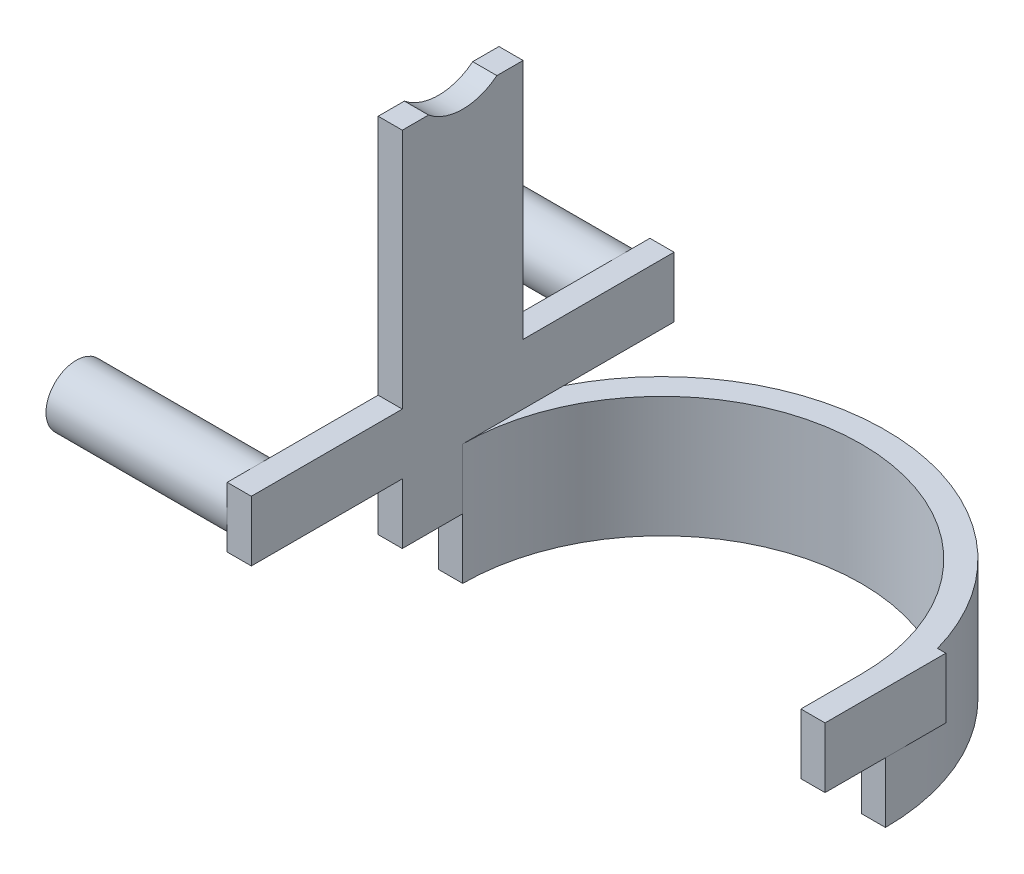
ISO-10303-21;
HEADER;
FILE_DESCRIPTION(('STEP AP214'),'2;1');
FILE_NAME('part.step','',(''),(''),'','','');
FILE_SCHEMA(('AUTOMOTIVE_DESIGN { 1 0 10303 214 1 1 1 1 }'));
ENDSEC;
DATA;
#1=APPLICATION_CONTEXT('core data for automotive mechanical design processes');
#2=APPLICATION_PROTOCOL_DEFINITION('international standard','automotive_design',2000,#1);
#3=PRODUCT_CONTEXT('',#1,'mechanical');
#4=PRODUCT('Part','Part','',(#3));
#5=PRODUCT_RELATED_PRODUCT_CATEGORY('part','',(#4));
#6=PRODUCT_DEFINITION_FORMATION('','',#4);
#7=PRODUCT_DEFINITION_CONTEXT('part definition',#1,'design');
#8=PRODUCT_DEFINITION('design','',#6,#7);
#9=PRODUCT_DEFINITION_SHAPE('','',#8);
#10=(LENGTH_UNIT() NAMED_UNIT(*) SI_UNIT(.MILLI.,.METRE.));
#11=(NAMED_UNIT(*) PLANE_ANGLE_UNIT() SI_UNIT($,.RADIAN.));
#12=(NAMED_UNIT(*) SI_UNIT($,.STERADIAN.) SOLID_ANGLE_UNIT());
#13=UNCERTAINTY_MEASURE_WITH_UNIT(LENGTH_MEASURE(1.E-05),#10,'distance_accuracy_value','');
#14=(GEOMETRIC_REPRESENTATION_CONTEXT(3) GLOBAL_UNCERTAINTY_ASSIGNED_CONTEXT((#13)) GLOBAL_UNIT_ASSIGNED_CONTEXT((#10,
#11,#12)) REPRESENTATION_CONTEXT('',''));
#15=CARTESIAN_POINT('',(0.,0.,0.));
#16=DIRECTION('',(0.,0.,1.));
#17=DIRECTION('',(1.,0.,0.));
#18=AXIS2_PLACEMENT_3D('',#15,#16,#17);
#19=CARTESIAN_POINT('',(-74.,40.,-20.));
#20=DIRECTION('',(1.,0.,0.));
#21=DIRECTION('',(0.,0.,-1.));
#22=AXIS2_PLACEMENT_3D('',#19,#20,#21);
#23=PLANE('',#22);
#24=CARTESIAN_POINT('',(-74.,50.,60.));
#25=DIRECTION('',(-1.,0.,0.));
#26=DIRECTION('',(0.,0.,1.));
#27=AXIS2_PLACEMENT_3D('',#24,#25,#26);
#28=CIRCLE('',#27,9.99999999999999);
#29=CARTESIAN_POINT('',(-74.,40.,60.));
#30=VERTEX_POINT('',#29);
#31=CARTESIAN_POINT('',(-74.,50.,70.));
#32=VERTEX_POINT('',#31);
#33=EDGE_CURVE('E239',#30,#32,#28,.T.);
#34=ORIENTED_EDGE('',*,*,#33,.F.);
#35=DIRECTION('',(0.,0.,1.));
#36=VECTOR('',#35,1.);
#37=CARTESIAN_POINT('',(-74.,40.,-70.));
#38=LINE('',#37,#36);
#39=CARTESIAN_POINT('',(-74.,40.,70.));
#40=VERTEX_POINT('',#39);
#41=EDGE_CURVE('E225',#30,#40,#38,.T.);
#42=ORIENTED_EDGE('',*,*,#41,.T.);
#43=DIRECTION('',(0.,1.,0.));
#44=VECTOR('',#43,1.);
#45=CARTESIAN_POINT('',(-74.,60.,70.));
#46=LINE('',#45,#44);
#47=EDGE_CURVE('E240',#40,#32,#46,.T.);
#48=ORIENTED_EDGE('',*,*,#47,.T.);
#49=EDGE_LOOP('',(#34,#42,#48));
#50=FACE_BOUND('',#49,.T.);
#51=ADVANCED_FACE('F39',(#50),#23,.F.);
#52=CARTESIAN_POINT('',(-74.,60.,60.));
#53=VERTEX_POINT('',#52);
#54=EDGE_CURVE('E64',#32,#53,#28,.T.);
#55=ORIENTED_EDGE('',*,*,#54,.F.);
#56=CARTESIAN_POINT('',(-74.,60.,70.));
#57=VERTEX_POINT('',#56);
#58=EDGE_CURVE('E285',#32,#57,#46,.T.);
#59=ORIENTED_EDGE('',*,*,#58,.T.);
#60=DIRECTION('',(0.,0.,-1.));
#61=VECTOR('',#60,1.);
#62=CARTESIAN_POINT('',(-74.,60.,-70.));
#63=LINE('',#62,#61);
#64=EDGE_CURVE('E266',#57,#53,#63,.T.);
#65=ORIENTED_EDGE('',*,*,#64,.T.);
#66=EDGE_LOOP('',(#55,#59,#65));
#67=FACE_BOUND('',#66,.T.);
#68=ADVANCED_FACE('F552',(#67),#23,.F.);
#69=CARTESIAN_POINT('',(-74.,50.,-60.));
#70=DIRECTION('',(-1.,0.,0.));
#71=DIRECTION('',(0.,0.,1.));
#72=AXIS2_PLACEMENT_3D('',#69,#70,#71);
#73=CIRCLE('',#72,10.);
#74=CARTESIAN_POINT('',(-74.,50.,-70.));
#75=VERTEX_POINT('',#74);
#76=CARTESIAN_POINT('',(-74.,40.,-60.));
#77=VERTEX_POINT('',#76);
#78=EDGE_CURVE('E259',#75,#77,#73,.T.);
#79=ORIENTED_EDGE('',*,*,#78,.F.);
#80=DIRECTION('',(0.,-1.,0.));
#81=VECTOR('',#80,1.);
#82=CARTESIAN_POINT('',(-74.,60.,-70.));
#83=LINE('',#82,#81);
#84=CARTESIAN_POINT('',(-74.,40.,-70.));
#85=VERTEX_POINT('',#84);
#86=EDGE_CURVE('E254',#75,#85,#83,.T.);
#87=ORIENTED_EDGE('',*,*,#86,.T.);
#88=EDGE_CURVE('E227',#85,#77,#38,.T.);
#89=ORIENTED_EDGE('',*,*,#88,.T.);
#90=EDGE_LOOP('',(#79,#87,#89));
#91=FACE_BOUND('',#90,.T.);
#92=ADVANCED_FACE('F558',(#91),#23,.F.);
#93=EDGE_CURVE('E56',#53,#30,#28,.T.);
#94=ORIENTED_EDGE('',*,*,#93,.F.);
#95=CARTESIAN_POINT('',(-74.,60.,20.));
#96=VERTEX_POINT('',#95);
#97=EDGE_CURVE('E291',#53,#96,#63,.T.);
#98=ORIENTED_EDGE('',*,*,#97,.T.);
#99=DIRECTION('',(0.,-1.,0.));
#100=VECTOR('',#99,1.);
#101=CARTESIAN_POINT('',(-74.,40.,20.));
#102=LINE('',#101,#100);
#103=CARTESIAN_POINT('',(-74.,140.,20.));
#104=VERTEX_POINT('',#103);
#105=EDGE_CURVE('E459',#104,#96,#102,.T.);
#106=ORIENTED_EDGE('',*,*,#105,.F.);
#107=DIRECTION('',(0.,0.,1.));
#108=VECTOR('',#107,1.);
#109=CARTESIAN_POINT('',(-74.,140.,20.));
#110=LINE('',#109,#108);
#111=CARTESIAN_POINT('',(-74.,140.,11.3137084989847));
#112=VERTEX_POINT('',#111);
#113=EDGE_CURVE('E414',#112,#104,#110,.T.);
#114=ORIENTED_EDGE('',*,*,#113,.F.);
#115=CARTESIAN_POINT('',(-74.,154.,0.));
#116=DIRECTION('',(-1.,0.,0.));
#117=DIRECTION('',(0.,0.,1.));
#118=AXIS2_PLACEMENT_3D('',#115,#116,#117);
#119=CIRCLE('',#118,18.);
#120=CARTESIAN_POINT('',(-74.,140.,-11.3137084989847));
#121=VERTEX_POINT('',#120);
#122=EDGE_CURVE('E399',#121,#112,#119,.T.);
#123=ORIENTED_EDGE('',*,*,#122,.F.);
#124=CARTESIAN_POINT('',(-74.,140.,-20.));
#125=VERTEX_POINT('',#124);
#126=EDGE_CURVE('E415',#125,#121,#110,.T.);
#127=ORIENTED_EDGE('',*,*,#126,.F.);
#128=DIRECTION('',(0.,-1.,0.));
#129=VECTOR('',#128,1.);
#130=CARTESIAN_POINT('',(-74.,40.,-20.));
#131=LINE('',#130,#129);
#132=CARTESIAN_POINT('',(-74.,60.,-20.));
#133=VERTEX_POINT('',#132);
#134=EDGE_CURVE('E464',#125,#133,#131,.T.);
#135=ORIENTED_EDGE('',*,*,#134,.T.);
#136=CARTESIAN_POINT('',(-74.,60.,-60.));
#137=VERTEX_POINT('',#136);
#138=EDGE_CURVE('E292',#133,#137,#63,.T.);
#139=ORIENTED_EDGE('',*,*,#138,.T.);
#140=EDGE_CURVE('E260',#77,#137,#73,.T.);
#141=ORIENTED_EDGE('',*,*,#140,.F.);
#142=CARTESIAN_POINT('',(-74.,40.,-20.));
#143=VERTEX_POINT('',#142);
#144=EDGE_CURVE('E224',#77,#143,#38,.T.);
#145=ORIENTED_EDGE('',*,*,#144,.T.);
#146=CARTESIAN_POINT('',(-74.,20.,-20.));
#147=VERTEX_POINT('',#146);
#148=EDGE_CURVE('E463',#143,#147,#131,.T.);
#149=ORIENTED_EDGE('',*,*,#148,.T.);
#150=DIRECTION('',(0.,0.,-1.));
#151=VECTOR('',#150,1.);
#152=CARTESIAN_POINT('',(-74.,20.,-20.));
#153=LINE('',#152,#151);
#154=CARTESIAN_POINT('',(-74.,20.,0.));
#155=VERTEX_POINT('',#154);
#156=EDGE_CURVE('E373',#155,#147,#153,.T.);
#157=ORIENTED_EDGE('',*,*,#156,.F.);
#158=CARTESIAN_POINT('',(-74.,20.,20.));
#159=VERTEX_POINT('',#158);
#160=EDGE_CURVE('E359',#159,#155,#153,.T.);
#161=ORIENTED_EDGE('',*,*,#160,.F.);
#162=CARTESIAN_POINT('',(-74.,40.,20.));
#163=VERTEX_POINT('',#162);
#164=EDGE_CURVE('E219',#163,#159,#102,.T.);
#165=ORIENTED_EDGE('',*,*,#164,.F.);
#166=EDGE_CURVE('E215',#163,#30,#38,.T.);
#167=ORIENTED_EDGE('',*,*,#166,.T.);
#168=EDGE_LOOP('',(#94,#98,#106,#114,#123,#127,#135,#139,#141,#145,#149,#157,#161,#165,#167));
#169=FACE_BOUND('',#168,.T.);
#170=ADVANCED_FACE('F217',(#169),#23,.F.);
#171=CARTESIAN_POINT('',(-74.,40.,-20.));
#172=DIRECTION('',(0.,0.,1.));
#173=DIRECTION('',(1.,0.,0.));
#174=AXIS2_PLACEMENT_3D('',#171,#172,#173);
#175=PLANE('',#174);
#176=DIRECTION('',(0.,-1.,0.));
#177=VECTOR('',#176,1.);
#178=CARTESIAN_POINT('',(-66.,140.,-20.));
#179=LINE('',#178,#177);
#180=CARTESIAN_POINT('',(-66.,140.,-20.));
#181=VERTEX_POINT('',#180);
#182=CARTESIAN_POINT('',(-66.,60.,-20.));
#183=VERTEX_POINT('',#182);
#184=EDGE_CURVE('E431',#181,#183,#179,.T.);
#185=ORIENTED_EDGE('',*,*,#184,.T.);
#186=DIRECTION('',(-1.,0.,0.));
#187=VECTOR('',#186,1.);
#188=CARTESIAN_POINT('',(-74.,60.,-20.));
#189=LINE('',#188,#187);
#190=EDGE_CURVE('E316',#183,#133,#189,.T.);
#191=ORIENTED_EDGE('',*,*,#190,.T.);
#192=ORIENTED_EDGE('',*,*,#134,.F.);
#193=DIRECTION('',(-1.,0.,0.));
#194=VECTOR('',#193,1.);
#195=CARTESIAN_POINT('',(-74.,140.,-20.));
#196=LINE('',#195,#194);
#197=EDGE_CURVE('E428',#181,#125,#196,.T.);
#198=ORIENTED_EDGE('',*,*,#197,.F.);
#199=EDGE_LOOP('',(#185,#191,#192,#198));
#200=FACE_BOUND('',#199,.T.);
#201=ADVANCED_FACE('F574',(#200),#175,.F.);
#202=CARTESIAN_POINT('',(-74.,40.,20.));
#203=DIRECTION('',(0.,0.,-1.));
#204=DIRECTION('',(-1.,0.,0.));
#205=AXIS2_PLACEMENT_3D('',#202,#203,#204);
#206=PLANE('',#205);
#207=ORIENTED_EDGE('',*,*,#105,.T.);
#208=DIRECTION('',(1.,0.,0.));
#209=VECTOR('',#208,1.);
#210=CARTESIAN_POINT('',(-74.,60.,20.));
#211=LINE('',#210,#209);
#212=CARTESIAN_POINT('',(-66.,60.,20.));
#213=VERTEX_POINT('',#212);
#214=EDGE_CURVE('E311',#96,#213,#211,.T.);
#215=ORIENTED_EDGE('',*,*,#214,.T.);
#216=DIRECTION('',(0.,-1.,0.));
#217=VECTOR('',#216,1.);
#218=CARTESIAN_POINT('',(-66.,40.,20.));
#219=LINE('',#218,#217);
#220=CARTESIAN_POINT('',(-66.,140.,20.));
#221=VERTEX_POINT('',#220);
#222=EDGE_CURVE('E455',#221,#213,#219,.T.);
#223=ORIENTED_EDGE('',*,*,#222,.F.);
#224=DIRECTION('',(1.,0.,0.));
#225=VECTOR('',#224,1.);
#226=CARTESIAN_POINT('',(-74.,140.,20.));
#227=LINE('',#226,#225);
#228=EDGE_CURVE('E419',#104,#221,#227,.T.);
#229=ORIENTED_EDGE('',*,*,#228,.F.);
#230=EDGE_LOOP('',(#207,#215,#223,#229));
#231=FACE_BOUND('',#230,.T.);
#232=ADVANCED_FACE('F571',(#231),#206,.F.);
#233=CARTESIAN_POINT('',(0.,40.,0.));
#234=DIRECTION('',(0.,1.,0.));
#235=DIRECTION('',(0.,0.,1.));
#236=AXIS2_PLACEMENT_3D('',#233,#234,#235);
#237=PLANE('',#236);
#238=CARTESIAN_POINT('',(0.,40.,0.));
#239=DIRECTION('',(0.,1.,0.));
#240=DIRECTION('',(0.,0.,1.));
#241=AXIS2_PLACEMENT_3D('',#238,#239,#240);
#242=CIRCLE('',#241,74.);
#243=CARTESIAN_POINT('',(71.2460525222275,40.,-20.));
#244=VERTEX_POINT('',#243);
#245=CARTESIAN_POINT('',(-66.,40.,-33.466401061363));
#246=VERTEX_POINT('',#245);
#247=EDGE_CURVE('E441',#244,#246,#242,.T.);
#248=ORIENTED_EDGE('',*,*,#247,.T.);
#249=DIRECTION('',(0.,0.,-1.));
#250=VECTOR('',#249,1.);
#251=CARTESIAN_POINT('',(-66.,40.,20.));
#252=LINE('',#251,#250);
#253=CARTESIAN_POINT('',(-66.,40.,0.));
#254=VERTEX_POINT('',#253);
#255=EDGE_CURVE('E11',#254,#246,#252,.T.);
#256=ORIENTED_EDGE('',*,*,#255,.F.);
#257=CARTESIAN_POINT('',(0.,40.,0.));
#258=DIRECTION('',(0.,-1.,0.));
#259=DIRECTION('',(0.,0.,1.));
#260=AXIS2_PLACEMENT_3D('',#257,#258,#259);
#261=CIRCLE('',#260,66.);
#262=CARTESIAN_POINT('',(66.,40.,0.));
#263=VERTEX_POINT('',#262);
#264=EDGE_CURVE('E436',#254,#263,#261,.T.);
#265=ORIENTED_EDGE('',*,*,#264,.T.);
#266=DIRECTION('',(0.,0.,-1.));
#267=VECTOR('',#266,1.);
#268=CARTESIAN_POINT('',(66.,40.,0.));
#269=LINE('',#268,#267);
#270=CARTESIAN_POINT('',(66.,40.,20.));
#271=VERTEX_POINT('',#270);
#272=EDGE_CURVE('E395',#271,#263,#269,.T.);
#273=ORIENTED_EDGE('',*,*,#272,.F.);
#274=DIRECTION('',(-1.,0.,0.));
#275=VECTOR('',#274,1.);
#276=CARTESIAN_POINT('',(74.,40.,20.));
#277=LINE('',#276,#275);
#278=CARTESIAN_POINT('',(74.,40.,20.));
#279=VERTEX_POINT('',#278);
#280=EDGE_CURVE('E391',#279,#271,#277,.T.);
#281=ORIENTED_EDGE('',*,*,#280,.F.);
#282=DIRECTION('',(0.,0.,-1.));
#283=VECTOR('',#282,1.);
#284=CARTESIAN_POINT('',(74.,40.,-20.));
#285=LINE('',#284,#283);
#286=CARTESIAN_POINT('',(74.,40.,-20.));
#287=VERTEX_POINT('',#286);
#288=EDGE_CURVE('E384',#279,#287,#285,.T.);
#289=ORIENTED_EDGE('',*,*,#288,.T.);
#290=DIRECTION('',(1.,0.,0.));
#291=VECTOR('',#290,1.);
#292=CARTESIAN_POINT('',(64.,40.,-20.));
#293=LINE('',#292,#291);
#294=EDGE_CURVE('E387',#244,#287,#293,.T.);
#295=ORIENTED_EDGE('',*,*,#294,.F.);
#296=EDGE_LOOP('',(#248,#256,#265,#273,#281,#289,#295));
#297=FACE_BOUND('',#296,.T.);
#298=ADVANCED_FACE('F634',(#297),#237,.T.);
#299=CARTESIAN_POINT('',(66.,40.,0.));
#300=DIRECTION('',(1.,0.,0.));
#301=DIRECTION('',(0.,0.,-1.));
#302=AXIS2_PLACEMENT_3D('',#299,#300,#301);
#303=PLANE('',#302);
#304=DIRECTION('',(0.,0.,1.));
#305=VECTOR('',#304,1.);
#306=CARTESIAN_POINT('',(66.,20.,20.));
#307=LINE('',#306,#305);
#308=CARTESIAN_POINT('',(66.,20.,0.));
#309=VERTEX_POINT('',#308);
#310=CARTESIAN_POINT('',(66.,20.,20.));
#311=VERTEX_POINT('',#310);
#312=EDGE_CURVE('E342',#309,#311,#307,.T.);
#313=ORIENTED_EDGE('',*,*,#312,.T.);
#314=DIRECTION('',(0.,-1.,0.));
#315=VECTOR('',#314,1.);
#316=CARTESIAN_POINT('',(66.,40.,20.));
#317=LINE('',#316,#315);
#318=EDGE_CURVE('E483',#271,#311,#317,.T.);
#319=ORIENTED_EDGE('',*,*,#318,.F.);
#320=ORIENTED_EDGE('',*,*,#272,.T.);
#321=DIRECTION('',(0.,-1.,0.));
#322=VECTOR('',#321,1.);
#323=CARTESIAN_POINT('',(66.,40.,0.));
#324=LINE('',#323,#322);
#325=EDGE_CURVE('E43',#263,#309,#324,.T.);
#326=ORIENTED_EDGE('',*,*,#325,.T.);
#327=EDGE_LOOP('',(#313,#319,#320,#326));
#328=FACE_BOUND('',#327,.T.);
#329=ADVANCED_FACE('F492',(#328),#303,.F.);
#330=CARTESIAN_POINT('',(74.,40.,20.));
#331=DIRECTION('',(0.,0.,-1.));
#332=DIRECTION('',(-1.,0.,0.));
#333=AXIS2_PLACEMENT_3D('',#330,#331,#332);
#334=PLANE('',#333);
#335=DIRECTION('',(1.,0.,0.));
#336=VECTOR('',#335,1.);
#337=CARTESIAN_POINT('',(71.2460525222275,20.,20.));
#338=LINE('',#337,#336);
#339=CARTESIAN_POINT('',(74.,20.,20.));
#340=VERTEX_POINT('',#339);
#341=EDGE_CURVE('E346',#311,#340,#338,.T.);
#342=ORIENTED_EDGE('',*,*,#341,.T.);
#343=DIRECTION('',(0.,-1.,0.));
#344=VECTOR('',#343,1.);
#345=CARTESIAN_POINT('',(74.,40.,20.));
#346=LINE('',#345,#344);
#347=EDGE_CURVE('E480',#279,#340,#346,.T.);
#348=ORIENTED_EDGE('',*,*,#347,.F.);
#349=ORIENTED_EDGE('',*,*,#280,.T.);
#350=ORIENTED_EDGE('',*,*,#318,.T.);
#351=EDGE_LOOP('',(#342,#348,#349,#350));
#352=FACE_BOUND('',#351,.T.);
#353=ADVANCED_FACE('F632',(#352),#334,.F.);
#354=CARTESIAN_POINT('',(74.,40.,-20.));
#355=DIRECTION('',(-1.,0.,0.));
#356=DIRECTION('',(0.,0.,1.));
#357=AXIS2_PLACEMENT_3D('',#354,#355,#356);
#358=PLANE('',#357);
#359=DIRECTION('',(0.,0.,1.));
#360=VECTOR('',#359,1.);
#361=CARTESIAN_POINT('',(74.,20.,-20.));
#362=LINE('',#361,#360);
#363=CARTESIAN_POINT('',(74.,20.,-20.));
#364=VERTEX_POINT('',#363);
#365=CARTESIAN_POINT('',(74.,20.,0.));
#366=VERTEX_POINT('',#365);
#367=EDGE_CURVE('E380',#364,#366,#362,.T.);
#368=ORIENTED_EDGE('',*,*,#367,.F.);
#369=DIRECTION('',(0.,-1.,0.));
#370=VECTOR('',#369,1.);
#371=CARTESIAN_POINT('',(74.,40.,-20.));
#372=LINE('',#371,#370);
#373=EDGE_CURVE('E476',#287,#364,#372,.T.);
#374=ORIENTED_EDGE('',*,*,#373,.F.);
#375=ORIENTED_EDGE('',*,*,#288,.F.);
#376=ORIENTED_EDGE('',*,*,#347,.T.);
#377=EDGE_CURVE('E383',#366,#340,#362,.T.);
#378=ORIENTED_EDGE('',*,*,#377,.F.);
#379=EDGE_LOOP('',(#368,#374,#375,#376,#378));
#380=FACE_BOUND('',#379,.T.);
#381=ADVANCED_FACE('F630',(#380),#358,.F.);
#382=CARTESIAN_POINT('',(74.,40.,-20.));
#383=DIRECTION('',(0.,0.,1.));
#384=DIRECTION('',(1.,0.,0.));
#385=AXIS2_PLACEMENT_3D('',#382,#383,#384);
#386=PLANE('',#385);
#387=DIRECTION('',(1.,0.,0.));
#388=VECTOR('',#387,1.);
#389=CARTESIAN_POINT('',(74.,20.,-20.));
#390=LINE('',#389,#388);
#391=CARTESIAN_POINT('',(71.2460525222275,20.,-20.));
#392=VERTEX_POINT('',#391);
#393=EDGE_CURVE('E377',#392,#364,#390,.T.);
#394=ORIENTED_EDGE('',*,*,#393,.F.);
#395=DIRECTION('',(0.,-1.,0.));
#396=VECTOR('',#395,1.);
#397=CARTESIAN_POINT('',(71.2460525222275,40.,-20.));
#398=LINE('',#397,#396);
#399=EDGE_CURVE('E472',#244,#392,#398,.T.);
#400=ORIENTED_EDGE('',*,*,#399,.F.);
#401=ORIENTED_EDGE('',*,*,#294,.T.);
#402=ORIENTED_EDGE('',*,*,#373,.T.);
#403=EDGE_LOOP('',(#394,#400,#401,#402));
#404=FACE_BOUND('',#403,.T.);
#405=ADVANCED_FACE('F572',(#404),#386,.F.);
#406=ORIENTED_EDGE('',*,*,#148,.F.);
#407=DIRECTION('',(1.,0.,0.));
#408=VECTOR('',#407,1.);
#409=CARTESIAN_POINT('',(-74.,40.,-20.));
#410=LINE('',#409,#408);
#411=CARTESIAN_POINT('',(-71.2460525222275,40.,-20.));
#412=VERTEX_POINT('',#411);
#413=EDGE_CURVE('E307',#143,#412,#410,.T.);
#414=ORIENTED_EDGE('',*,*,#413,.T.);
#415=DIRECTION('',(0.,-1.,0.));
#416=VECTOR('',#415,1.);
#417=CARTESIAN_POINT('',(-71.2460525222275,40.,-20.));
#418=LINE('',#417,#416);
#419=CARTESIAN_POINT('',(-71.2460525222275,20.,-20.));
#420=VERTEX_POINT('',#419);
#421=EDGE_CURVE('E468',#412,#420,#418,.T.);
#422=ORIENTED_EDGE('',*,*,#421,.T.);
#423=DIRECTION('',(1.,0.,0.));
#424=VECTOR('',#423,1.);
#425=CARTESIAN_POINT('',(-74.,20.,-20.));
#426=LINE('',#425,#424);
#427=EDGE_CURVE('E374',#147,#420,#426,.T.);
#428=ORIENTED_EDGE('',*,*,#427,.F.);
#429=EDGE_LOOP('',(#406,#414,#422,#428));
#430=FACE_BOUND('',#429,.T.);
#431=ADVANCED_FACE('F563',(#430),#175,.F.);
#432=EDGE_CURVE('E255',#137,#75,#73,.T.);
#433=ORIENTED_EDGE('',*,*,#432,.F.);
#434=CARTESIAN_POINT('',(-74.,60.,-70.));
#435=VERTEX_POINT('',#434);
#436=EDGE_CURVE('E288',#137,#435,#63,.T.);
#437=ORIENTED_EDGE('',*,*,#436,.T.);
#438=EDGE_CURVE('E237',#435,#75,#83,.T.);
#439=ORIENTED_EDGE('',*,*,#438,.T.);
#440=EDGE_LOOP('',(#433,#437,#439));
#441=FACE_BOUND('',#440,.T.);
#442=ADVANCED_FACE('F554',(#441),#23,.F.);
#443=CARTESIAN_POINT('',(-66.,40.,20.));
#444=VERTEX_POINT('',#443);
#445=CARTESIAN_POINT('',(-66.,20.,20.));
#446=VERTEX_POINT('',#445);
#447=EDGE_CURVE('E454',#444,#446,#219,.T.);
#448=ORIENTED_EDGE('',*,*,#447,.F.);
#449=DIRECTION('',(-1.,0.,0.));
#450=VECTOR('',#449,1.);
#451=CARTESIAN_POINT('',(-74.,40.,20.));
#452=LINE('',#451,#450);
#453=EDGE_CURVE('E297',#444,#163,#452,.T.);
#454=ORIENTED_EDGE('',*,*,#453,.T.);
#455=ORIENTED_EDGE('',*,*,#164,.T.);
#456=DIRECTION('',(1.,0.,0.));
#457=VECTOR('',#456,1.);
#458=CARTESIAN_POINT('',(-71.2460525222275,20.,20.));
#459=LINE('',#458,#457);
#460=EDGE_CURVE('E320',#159,#446,#459,.T.);
#461=ORIENTED_EDGE('',*,*,#460,.T.);
#462=EDGE_LOOP('',(#448,#454,#455,#461));
#463=FACE_BOUND('',#462,.T.);
#464=ADVANCED_FACE('F562',(#463),#206,.F.);
#465=CARTESIAN_POINT('',(-66.,40.,0.));
#466=DIRECTION('',(-1.,0.,0.));
#467=DIRECTION('',(0.,0.,1.));
#468=AXIS2_PLACEMENT_3D('',#465,#466,#467);
#469=PLANE('',#468);
#470=DIRECTION('',(0.,-1.,0.));
#471=VECTOR('',#470,1.);
#472=CARTESIAN_POINT('',(-66.,40.,0.));
#473=LINE('',#472,#471);
#474=CARTESIAN_POINT('',(-66.,20.,0.));
#475=VERTEX_POINT('',#474);
#476=EDGE_CURVE('E445',#254,#475,#473,.T.);
#477=ORIENTED_EDGE('',*,*,#476,.F.);
#478=ORIENTED_EDGE('',*,*,#255,.T.);
#479=DIRECTION('',(0.,0.,1.));
#480=VECTOR('',#479,1.);
#481=CARTESIAN_POINT('',(-66.,40.,-70.));
#482=LINE('',#481,#480);
#483=CARTESIAN_POINT('',(-66.,40.,-70.));
#484=VERTEX_POINT('',#483);
#485=EDGE_CURVE('E267',#484,#246,#482,.T.);
#486=ORIENTED_EDGE('',*,*,#485,.F.);
#487=DIRECTION('',(0.,-1.,0.));
#488=VECTOR('',#487,1.);
#489=CARTESIAN_POINT('',(-66.,60.,-70.));
#490=LINE('',#489,#488);
#491=CARTESIAN_POINT('',(-66.,60.,-70.));
#492=VERTEX_POINT('',#491);
#493=EDGE_CURVE('E261',#492,#484,#490,.T.);
#494=ORIENTED_EDGE('',*,*,#493,.F.);
#495=DIRECTION('',(0.,0.,-1.));
#496=VECTOR('',#495,1.);
#497=CARTESIAN_POINT('',(-66.,60.,-70.));
#498=LINE('',#497,#496);
#499=EDGE_CURVE('E275',#183,#492,#498,.T.);
#500=ORIENTED_EDGE('',*,*,#499,.F.);
#501=ORIENTED_EDGE('',*,*,#184,.F.);
#502=DIRECTION('',(0.,0.,-1.));
#503=VECTOR('',#502,1.);
#504=CARTESIAN_POINT('',(-66.,140.,20.));
#505=LINE('',#504,#503);
#506=CARTESIAN_POINT('',(-66.,140.,-11.3137084989847));
#507=VERTEX_POINT('',#506);
#508=EDGE_CURVE('E423',#507,#181,#505,.T.);
#509=ORIENTED_EDGE('',*,*,#508,.F.);
#510=CARTESIAN_POINT('',(-66.,154.,0.));
#511=DIRECTION('',(-1.,0.,0.));
#512=DIRECTION('',(0.,0.,1.));
#513=AXIS2_PLACEMENT_3D('',#510,#511,#512);
#514=CIRCLE('',#513,18.);
#515=CARTESIAN_POINT('',(-66.,140.,11.3137084989847));
#516=VERTEX_POINT('',#515);
#517=EDGE_CURVE('E406',#507,#516,#514,.T.);
#518=ORIENTED_EDGE('',*,*,#517,.T.);
#519=EDGE_CURVE('E424',#221,#516,#505,.T.);
#520=ORIENTED_EDGE('',*,*,#519,.F.);
#521=ORIENTED_EDGE('',*,*,#222,.T.);
#522=CARTESIAN_POINT('',(-66.,60.,70.));
#523=VERTEX_POINT('',#522);
#524=EDGE_CURVE('E276',#523,#213,#498,.T.);
#525=ORIENTED_EDGE('',*,*,#524,.F.);
#526=DIRECTION('',(0.,1.,0.));
#527=VECTOR('',#526,1.);
#528=CARTESIAN_POINT('',(-66.,60.,70.));
#529=LINE('',#528,#527);
#530=CARTESIAN_POINT('',(-66.,40.,70.));
#531=VERTEX_POINT('',#530);
#532=EDGE_CURVE('E271',#531,#523,#529,.T.);
#533=ORIENTED_EDGE('',*,*,#532,.F.);
#534=EDGE_CURVE('E265',#444,#531,#482,.T.);
#535=ORIENTED_EDGE('',*,*,#534,.F.);
#536=ORIENTED_EDGE('',*,*,#447,.T.);
#537=DIRECTION('',(0.,0.,-1.));
#538=VECTOR('',#537,1.);
#539=CARTESIAN_POINT('',(-66.,20.,20.));
#540=LINE('',#539,#538);
#541=EDGE_CURVE('E324',#446,#475,#540,.T.);
#542=ORIENTED_EDGE('',*,*,#541,.T.);
#543=EDGE_LOOP('',(#477,#478,#486,#494,#500,#501,#509,#518,#520,#521,#525,#533,#535,#536,#542));
#544=FACE_BOUND('',#543,.T.);
#545=ADVANCED_FACE('F569',(#544),#469,.F.);
#546=CARTESIAN_POINT('',(0.,0.,0.));
#547=DIRECTION('',(0.,1.,0.));
#548=DIRECTION('',(0.,0.,1.));
#549=AXIS2_PLACEMENT_3D('',#546,#547,#548);
#550=PLANE('',#549);
#551=DIRECTION('',(-1.,0.,0.));
#552=VECTOR('',#551,1.);
#553=CARTESIAN_POINT('',(74.,0.,0.));
#554=LINE('',#553,#552);
#555=CARTESIAN_POINT('',(74.,0.,0.));
#556=VERTEX_POINT('',#555);
#557=CARTESIAN_POINT('',(66.,0.,0.));
#558=VERTEX_POINT('',#557);
#559=EDGE_CURVE('E325',#556,#558,#554,.T.);
#560=ORIENTED_EDGE('',*,*,#559,.T.);
#561=CARTESIAN_POINT('',(0.,0.,0.));
#562=DIRECTION('',(0.,-1.,0.));
#563=DIRECTION('',(0.,0.,1.));
#564=AXIS2_PLACEMENT_3D('',#561,#562,#563);
#565=CIRCLE('',#564,66.);
#566=CARTESIAN_POINT('',(-66.,0.,0.));
#567=VERTEX_POINT('',#566);
#568=EDGE_CURVE('E435',#567,#558,#565,.T.);
#569=ORIENTED_EDGE('',*,*,#568,.F.);
#570=DIRECTION('',(-1.,0.,0.));
#571=VECTOR('',#570,1.);
#572=CARTESIAN_POINT('',(-74.,0.,0.));
#573=LINE('',#572,#571);
#574=CARTESIAN_POINT('',(-74.,0.,0.));
#575=VERTEX_POINT('',#574);
#576=EDGE_CURVE('E319',#567,#575,#573,.T.);
#577=ORIENTED_EDGE('',*,*,#576,.T.);
#578=CARTESIAN_POINT('',(0.,0.,0.));
#579=DIRECTION('',(0.,1.,0.));
#580=DIRECTION('',(0.,0.,1.));
#581=AXIS2_PLACEMENT_3D('',#578,#579,#580);
#582=CIRCLE('',#581,74.);
#583=EDGE_CURVE('E440',#556,#575,#582,.T.);
#584=ORIENTED_EDGE('',*,*,#583,.F.);
#585=EDGE_LOOP('',(#560,#569,#577,#584));
#586=FACE_BOUND('',#585,.T.);
#587=ADVANCED_FACE('F503',(#586),#550,.F.);
#588=CARTESIAN_POINT('',(0.,140.,0.));
#589=DIRECTION('',(0.,-1.,0.));
#590=DIRECTION('',(0.,0.,-1.));
#591=AXIS2_PLACEMENT_3D('',#588,#589,#590);
#592=PLANE('',#591);
#593=ORIENTED_EDGE('',*,*,#519,.T.);
#594=DIRECTION('',(-1.,0.,0.));
#595=VECTOR('',#594,1.);
#596=CARTESIAN_POINT('',(74.,140.,11.3137084989847));
#597=LINE('',#596,#595);
#598=EDGE_CURVE('E410',#516,#112,#597,.T.);
#599=ORIENTED_EDGE('',*,*,#598,.T.);
#600=ORIENTED_EDGE('',*,*,#113,.T.);
#601=ORIENTED_EDGE('',*,*,#228,.T.);
#602=EDGE_LOOP('',(#593,#599,#600,#601));
#603=FACE_BOUND('',#602,.T.);
#604=ADVANCED_FACE('F653',(#603),#592,.F.);
#605=CARTESIAN_POINT('',(0.,40.,0.));
#606=DIRECTION('',(0.,-1.,0.));
#607=DIRECTION('',(0.,0.,-1.));
#608=AXIS2_PLACEMENT_3D('',#605,#606,#607);
#609=CYLINDRICAL_SURFACE('',#608,66.);
#610=ORIENTED_EDGE('',*,*,#568,.T.);
#611=DIRECTION('',(0.,-1.,0.));
#612=VECTOR('',#611,1.);
#613=CARTESIAN_POINT('',(66.,20.,0.));
#614=LINE('',#613,#612);
#615=EDGE_CURVE('E356',#309,#558,#614,.T.);
#616=ORIENTED_EDGE('',*,*,#615,.F.);
#617=ORIENTED_EDGE('',*,*,#325,.F.);
#618=ORIENTED_EDGE('',*,*,#264,.F.);
#619=ORIENTED_EDGE('',*,*,#476,.T.);
#620=DIRECTION('',(0.,-1.,0.));
#621=VECTOR('',#620,1.);
#622=CARTESIAN_POINT('',(-66.,20.,0.));
#623=LINE('',#622,#621);
#624=EDGE_CURVE('E349',#475,#567,#623,.T.);
#625=ORIENTED_EDGE('',*,*,#624,.T.);
#626=EDGE_LOOP('',(#610,#616,#617,#618,#619,#625));
#627=FACE_BOUND('',#626,.T.);
#628=ADVANCED_FACE('F41',(#627),#609,.F.);
#629=CARTESIAN_POINT('',(0.,40.,0.));
#630=DIRECTION('',(0.,-1.,0.));
#631=DIRECTION('',(0.,0.,-1.));
#632=AXIS2_PLACEMENT_3D('',#629,#630,#631);
#633=CYLINDRICAL_SURFACE('',#632,74.);
#634=ORIENTED_EDGE('',*,*,#583,.T.);
#635=DIRECTION('',(0.,-1.,0.));
#636=VECTOR('',#635,1.);
#637=CARTESIAN_POINT('',(-74.,20.,0.));
#638=LINE('',#637,#636);
#639=EDGE_CURVE('E364',#155,#575,#638,.T.);
#640=ORIENTED_EDGE('',*,*,#639,.F.);
#641=CARTESIAN_POINT('',(0.,20.,0.));
#642=DIRECTION('',(0.,-1.,0.));
#643=DIRECTION('',(0.,0.,-1.));
#644=AXIS2_PLACEMENT_3D('',#641,#642,#643);
#645=CIRCLE('',#644,74.);
#646=EDGE_CURVE('E334',#155,#420,#645,.T.);
#647=ORIENTED_EDGE('',*,*,#646,.T.);
#648=ORIENTED_EDGE('',*,*,#421,.F.);
#649=EDGE_CURVE('E439',#246,#412,#242,.T.);
#650=ORIENTED_EDGE('',*,*,#649,.F.);
#651=ORIENTED_EDGE('',*,*,#247,.F.);
#652=ORIENTED_EDGE('',*,*,#399,.T.);
#653=EDGE_CURVE('E333',#392,#366,#645,.T.);
#654=ORIENTED_EDGE('',*,*,#653,.T.);
#655=DIRECTION('',(0.,-1.,0.));
#656=VECTOR('',#655,1.);
#657=CARTESIAN_POINT('',(74.,20.,0.));
#658=LINE('',#657,#656);
#659=EDGE_CURVE('E360',#366,#556,#658,.T.);
#660=ORIENTED_EDGE('',*,*,#659,.T.);
#661=EDGE_LOOP('',(#634,#640,#647,#648,#650,#651,#652,#654,#660));
#662=FACE_BOUND('',#661,.T.);
#663=ADVANCED_FACE('F506',(#662),#633,.T.);
#664=ORIENTED_EDGE('',*,*,#126,.T.);
#665=DIRECTION('',(-1.,0.,0.));
#666=VECTOR('',#665,1.);
#667=CARTESIAN_POINT('',(74.,140.,-11.3137084989847));
#668=LINE('',#667,#666);
#669=EDGE_CURVE('E402',#121,#507,#668,.F.);
#670=ORIENTED_EDGE('',*,*,#669,.T.);
#671=ORIENTED_EDGE('',*,*,#508,.T.);
#672=ORIENTED_EDGE('',*,*,#197,.T.);
#673=EDGE_LOOP('',(#664,#670,#671,#672));
#674=FACE_BOUND('',#673,.T.);
#675=ADVANCED_FACE('F600',(#674),#592,.F.);
#676=CARTESIAN_POINT('',(74.,154.,0.));
#677=DIRECTION('',(-1.,0.,0.));
#678=DIRECTION('',(0.,0.,1.));
#679=AXIS2_PLACEMENT_3D('',#676,#677,#678);
#680=CYLINDRICAL_SURFACE('',#679,18.);
#681=ORIENTED_EDGE('',*,*,#517,.F.);
#682=ORIENTED_EDGE('',*,*,#669,.F.);
#683=ORIENTED_EDGE('',*,*,#122,.T.);
#684=ORIENTED_EDGE('',*,*,#598,.F.);
#685=EDGE_LOOP('',(#681,#682,#683,#684));
#686=FACE_BOUND('',#685,.T.);
#687=ADVANCED_FACE('F655',(#686),#680,.F.);
#688=CARTESIAN_POINT('',(-74.,20.,0.));
#689=DIRECTION('',(0.,0.,1.));
#690=DIRECTION('',(1.,0.,0.));
#691=AXIS2_PLACEMENT_3D('',#688,#689,#690);
#692=PLANE('',#691);
#693=ORIENTED_EDGE('',*,*,#576,.F.);
#694=ORIENTED_EDGE('',*,*,#624,.F.);
#695=DIRECTION('',(-1.,0.,0.));
#696=VECTOR('',#695,1.);
#697=CARTESIAN_POINT('',(-74.,20.,0.));
#698=LINE('',#697,#696);
#699=EDGE_CURVE('E329',#475,#155,#698,.T.);
#700=ORIENTED_EDGE('',*,*,#699,.T.);
#701=ORIENTED_EDGE('',*,*,#639,.T.);
#702=EDGE_LOOP('',(#693,#694,#700,#701));
#703=FACE_BOUND('',#702,.T.);
#704=ADVANCED_FACE('F510',(#703),#692,.T.);
#705=CARTESIAN_POINT('',(0.,20.,0.));
#706=DIRECTION('',(0.,-1.,0.));
#707=DIRECTION('',(0.,0.,-1.));
#708=AXIS2_PLACEMENT_3D('',#705,#706,#707);
#709=PLANE('',#708);
#710=ORIENTED_EDGE('',*,*,#160,.T.);
#711=ORIENTED_EDGE('',*,*,#699,.F.);
#712=ORIENTED_EDGE('',*,*,#541,.F.);
#713=ORIENTED_EDGE('',*,*,#460,.F.);
#714=EDGE_LOOP('',(#710,#711,#712,#713));
#715=FACE_BOUND('',#714,.T.);
#716=ADVANCED_FACE('F638',(#715),#709,.T.);
#717=ORIENTED_EDGE('',*,*,#427,.T.);
#718=ORIENTED_EDGE('',*,*,#646,.F.);
#719=ORIENTED_EDGE('',*,*,#156,.T.);
#720=EDGE_LOOP('',(#717,#718,#719));
#721=FACE_BOUND('',#720,.T.);
#722=ADVANCED_FACE('F910',(#721),#709,.T.);
#723=ORIENTED_EDGE('',*,*,#377,.T.);
#724=ORIENTED_EDGE('',*,*,#341,.F.);
#725=ORIENTED_EDGE('',*,*,#312,.F.);
#726=DIRECTION('',(-1.,0.,0.));
#727=VECTOR('',#726,1.);
#728=CARTESIAN_POINT('',(74.,20.,0.));
#729=LINE('',#728,#727);
#730=EDGE_CURVE('E338',#366,#309,#729,.T.);
#731=ORIENTED_EDGE('',*,*,#730,.F.);
#732=EDGE_LOOP('',(#723,#724,#725,#731));
#733=FACE_BOUND('',#732,.T.);
#734=ADVANCED_FACE('F625',(#733),#709,.T.);
#735=ORIENTED_EDGE('',*,*,#367,.T.);
#736=ORIENTED_EDGE('',*,*,#653,.F.);
#737=ORIENTED_EDGE('',*,*,#393,.T.);
#738=EDGE_LOOP('',(#735,#736,#737));
#739=FACE_BOUND('',#738,.T.);
#740=ADVANCED_FACE('F902',(#739),#709,.T.);
#741=CARTESIAN_POINT('',(74.,20.,0.));
#742=DIRECTION('',(0.,0.,1.));
#743=DIRECTION('',(1.,0.,0.));
#744=AXIS2_PLACEMENT_3D('',#741,#742,#743);
#745=PLANE('',#744);
#746=ORIENTED_EDGE('',*,*,#559,.F.);
#747=ORIENTED_EDGE('',*,*,#659,.F.);
#748=ORIENTED_EDGE('',*,*,#730,.T.);
#749=ORIENTED_EDGE('',*,*,#615,.T.);
#750=EDGE_LOOP('',(#746,#747,#748,#749));
#751=FACE_BOUND('',#750,.T.);
#752=ADVANCED_FACE('F499',(#751),#745,.T.);
#753=CARTESIAN_POINT('',(-66.,60.,-70.));
#754=DIRECTION('',(0.,0.,-1.));
#755=DIRECTION('',(-1.,0.,0.));
#756=AXIS2_PLACEMENT_3D('',#753,#754,#755);
#757=PLANE('',#756);
#758=ORIENTED_EDGE('',*,*,#438,.F.);
#759=DIRECTION('',(-1.,0.,0.));
#760=VECTOR('',#759,1.);
#761=CARTESIAN_POINT('',(-66.,60.,-70.));
#762=LINE('',#761,#760);
#763=EDGE_CURVE('E293',#492,#435,#762,.T.);
#764=ORIENTED_EDGE('',*,*,#763,.F.);
#765=ORIENTED_EDGE('',*,*,#493,.T.);
#766=DIRECTION('',(-1.,0.,0.));
#767=VECTOR('',#766,1.);
#768=CARTESIAN_POINT('',(-66.,40.,-70.));
#769=LINE('',#768,#767);
#770=EDGE_CURVE('E280',#484,#85,#769,.T.);
#771=ORIENTED_EDGE('',*,*,#770,.T.);
#772=ORIENTED_EDGE('',*,*,#86,.F.);
#773=EDGE_LOOP('',(#758,#764,#765,#771,#772));
#774=FACE_BOUND('',#773,.T.);
#775=ADVANCED_FACE('F609',(#774),#757,.T.);
#776=CARTESIAN_POINT('',(-66.,40.,-70.));
#777=DIRECTION('',(0.,-1.,0.));
#778=DIRECTION('',(0.,0.,-1.));
#779=AXIS2_PLACEMENT_3D('',#776,#777,#778);
#780=PLANE('',#779);
#781=ORIENTED_EDGE('',*,*,#413,.F.);
#782=ORIENTED_EDGE('',*,*,#144,.F.);
#783=ORIENTED_EDGE('',*,*,#88,.F.);
#784=ORIENTED_EDGE('',*,*,#770,.F.);
#785=ORIENTED_EDGE('',*,*,#485,.T.);
#786=ORIENTED_EDGE('',*,*,#649,.T.);
#787=EDGE_LOOP('',(#781,#782,#783,#784,#785,#786));
#788=FACE_BOUND('',#787,.T.);
#789=ADVANCED_FACE('F615',(#788),#780,.T.);
#790=CARTESIAN_POINT('',(-66.,60.,-70.));
#791=DIRECTION('',(0.,1.,0.));
#792=DIRECTION('',(0.,0.,1.));
#793=AXIS2_PLACEMENT_3D('',#790,#791,#792);
#794=PLANE('',#793);
#795=ORIENTED_EDGE('',*,*,#190,.F.);
#796=ORIENTED_EDGE('',*,*,#499,.T.);
#797=ORIENTED_EDGE('',*,*,#763,.T.);
#798=ORIENTED_EDGE('',*,*,#436,.F.);
#799=ORIENTED_EDGE('',*,*,#138,.F.);
#800=EDGE_LOOP('',(#795,#796,#797,#798,#799));
#801=FACE_BOUND('',#800,.T.);
#802=ADVANCED_FACE('F593',(#801),#794,.T.);
#803=ORIENTED_EDGE('',*,*,#214,.F.);
#804=ORIENTED_EDGE('',*,*,#97,.F.);
#805=ORIENTED_EDGE('',*,*,#64,.F.);
#806=DIRECTION('',(-1.,0.,0.));
#807=VECTOR('',#806,1.);
#808=CARTESIAN_POINT('',(-66.,60.,70.));
#809=LINE('',#808,#807);
#810=EDGE_CURVE('E298',#523,#57,#809,.T.);
#811=ORIENTED_EDGE('',*,*,#810,.F.);
#812=ORIENTED_EDGE('',*,*,#524,.T.);
#813=EDGE_LOOP('',(#803,#804,#805,#811,#812));
#814=FACE_BOUND('',#813,.T.);
#815=ADVANCED_FACE('F646',(#814),#794,.T.);
#816=ORIENTED_EDGE('',*,*,#453,.F.);
#817=ORIENTED_EDGE('',*,*,#534,.T.);
#818=DIRECTION('',(-1.,0.,0.));
#819=VECTOR('',#818,1.);
#820=CARTESIAN_POINT('',(-66.,40.,70.));
#821=LINE('',#820,#819);
#822=EDGE_CURVE('E232',#531,#40,#821,.T.);
#823=ORIENTED_EDGE('',*,*,#822,.T.);
#824=ORIENTED_EDGE('',*,*,#41,.F.);
#825=ORIENTED_EDGE('',*,*,#166,.F.);
#826=EDGE_LOOP('',(#816,#817,#823,#824,#825));
#827=FACE_BOUND('',#826,.T.);
#828=ADVANCED_FACE('F230',(#827),#780,.T.);
#829=CARTESIAN_POINT('',(-66.,60.,70.));
#830=DIRECTION('',(0.,0.,1.));
#831=DIRECTION('',(0.,-1.,0.));
#832=AXIS2_PLACEMENT_3D('',#829,#830,#831);
#833=PLANE('',#832);
#834=ORIENTED_EDGE('',*,*,#47,.F.);
#835=ORIENTED_EDGE('',*,*,#822,.F.);
#836=ORIENTED_EDGE('',*,*,#532,.T.);
#837=ORIENTED_EDGE('',*,*,#810,.T.);
#838=ORIENTED_EDGE('',*,*,#58,.F.);
#839=EDGE_LOOP('',(#834,#835,#836,#837,#838));
#840=FACE_BOUND('',#839,.T.);
#841=ADVANCED_FACE('F642',(#840),#833,.T.);
#842=CARTESIAN_POINT('',(-134.,50.,-60.));
#843=DIRECTION('',(1.,0.,0.));
#844=DIRECTION('',(0.,0.,-1.));
#845=AXIS2_PLACEMENT_3D('',#842,#843,#844);
#846=CYLINDRICAL_SURFACE('',#845,10.);
#847=CARTESIAN_POINT('',(-134.,50.,-60.));
#848=DIRECTION('',(-1.,0.,0.));
#849=DIRECTION('',(0.,0.,1.));
#850=AXIS2_PLACEMENT_3D('',#847,#848,#849);
#851=CIRCLE('',#850,10.);
#852=CARTESIAN_POINT('',(-134.,50.,-50.));
#853=VERTEX_POINT('',#852);
#854=EDGE_CURVE('E250',#853,#853,#851,.T.);
#855=ORIENTED_EDGE('',*,*,#854,.F.);
#856=EDGE_LOOP('',(#855));
#857=FACE_BOUND('',#856,.T.);
#858=ORIENTED_EDGE('',*,*,#432,.T.);
#859=ORIENTED_EDGE('',*,*,#78,.T.);
#860=ORIENTED_EDGE('',*,*,#140,.T.);
#861=EDGE_LOOP('',(#858,#859,#860));
#862=FACE_BOUND('',#861,.T.);
#863=ADVANCED_FACE('F548',(#857,#862),#846,.T.);
#864=CARTESIAN_POINT('',(-134.,50.,-60.));
#865=DIRECTION('',(-1.,0.,0.));
#866=DIRECTION('',(0.,0.,1.));
#867=AXIS2_PLACEMENT_3D('',#864,#865,#866);
#868=PLANE('',#867);
#869=ORIENTED_EDGE('',*,*,#854,.T.);
#870=EDGE_LOOP('',(#869));
#871=FACE_BOUND('',#870,.T.);
#872=ADVANCED_FACE('F541',(#871),#868,.T.);
#873=CARTESIAN_POINT('',(-134.,50.,60.));
#874=DIRECTION('',(1.,0.,0.));
#875=DIRECTION('',(0.,0.,-1.));
#876=AXIS2_PLACEMENT_3D('',#873,#874,#875);
#877=CYLINDRICAL_SURFACE('',#876,9.99999999999999);
#878=CARTESIAN_POINT('',(-134.,50.,60.));
#879=DIRECTION('',(-1.,0.,0.));
#880=DIRECTION('',(0.,0.,1.));
#881=AXIS2_PLACEMENT_3D('',#878,#879,#880);
#882=CIRCLE('',#881,9.99999999999999);
#883=CARTESIAN_POINT('',(-134.,50.,70.));
#884=VERTEX_POINT('',#883);
#885=EDGE_CURVE('E247',#884,#884,#882,.T.);
#886=ORIENTED_EDGE('',*,*,#885,.F.);
#887=EDGE_LOOP('',(#886));
#888=FACE_BOUND('',#887,.T.);
#889=ORIENTED_EDGE('',*,*,#54,.T.);
#890=ORIENTED_EDGE('',*,*,#93,.T.);
#891=ORIENTED_EDGE('',*,*,#33,.T.);
#892=EDGE_LOOP('',(#889,#890,#891));
#893=FACE_BOUND('',#892,.T.);
#894=ADVANCED_FACE('F244',(#888,#893),#877,.T.);
#895=CARTESIAN_POINT('',(-134.,50.,60.));
#896=DIRECTION('',(-1.,0.,0.));
#897=DIRECTION('',(0.,0.,1.));
#898=AXIS2_PLACEMENT_3D('',#895,#896,#897);
#899=PLANE('',#898);
#900=ORIENTED_EDGE('',*,*,#885,.T.);
#901=EDGE_LOOP('',(#900));
#902=FACE_BOUND('',#901,.T.);
#903=ADVANCED_FACE('F538',(#902),#899,.T.);
#904=CLOSED_SHELL('',(#51,#68,#92,#170,#201,#232,#298,#329,#353,#381,#405,#431,#442,#464,#545,
#587,#604,#628,#663,#675,#687,#704,#716,#722,#734,#740,#752,#775,#789,#802,#815,#828,#841,#863,
#872,#894,#903));
#905=MANIFOLD_SOLID_BREP('B2',#904);
#906=ADVANCED_BREP_SHAPE_REPRESENTATION('',(#18,#905),#14);
#907=SHAPE_DEFINITION_REPRESENTATION(#9,#906);
ENDSEC;
END-ISO-10303-21;
